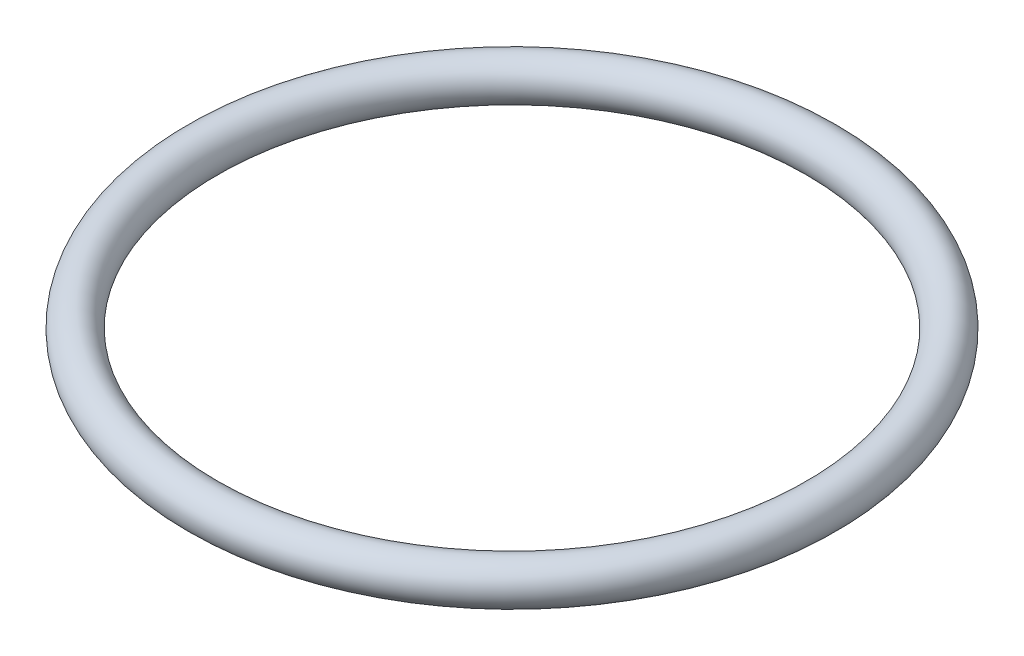
ISO-10303-21;
HEADER;
FILE_DESCRIPTION(('STEP AP214'),'2;1');
FILE_NAME('part.step','',(''),(''),'','','');
FILE_SCHEMA(('AUTOMOTIVE_DESIGN { 1 0 10303 214 1 1 1 1 }'));
ENDSEC;
DATA;
#1=APPLICATION_CONTEXT('core data for automotive mechanical design processes');
#2=APPLICATION_PROTOCOL_DEFINITION('international standard','automotive_design',2000,#1);
#3=PRODUCT_CONTEXT('',#1,'mechanical');
#4=PRODUCT('Part','Part','',(#3));
#5=PRODUCT_RELATED_PRODUCT_CATEGORY('part','',(#4));
#6=PRODUCT_DEFINITION_FORMATION('','',#4);
#7=PRODUCT_DEFINITION_CONTEXT('part definition',#1,'design');
#8=PRODUCT_DEFINITION('design','',#6,#7);
#9=PRODUCT_DEFINITION_SHAPE('','',#8);
#10=(LENGTH_UNIT() NAMED_UNIT(*) SI_UNIT(.MILLI.,.METRE.));
#11=(NAMED_UNIT(*) PLANE_ANGLE_UNIT() SI_UNIT($,.RADIAN.));
#12=(NAMED_UNIT(*) SI_UNIT($,.STERADIAN.) SOLID_ANGLE_UNIT());
#13=UNCERTAINTY_MEASURE_WITH_UNIT(LENGTH_MEASURE(1.E-05),#10,'distance_accuracy_value','');
#14=(GEOMETRIC_REPRESENTATION_CONTEXT(3) GLOBAL_UNCERTAINTY_ASSIGNED_CONTEXT((#13)) GLOBAL_UNIT_ASSIGNED_CONTEXT((#10,
#11,#12)) REPRESENTATION_CONTEXT('',''));
#15=CARTESIAN_POINT('',(0.,0.,0.));
#16=DIRECTION('',(0.,0.,1.));
#17=DIRECTION('',(1.,0.,0.));
#18=AXIS2_PLACEMENT_3D('',#15,#16,#17);
#19=CARTESIAN_POINT('',(0.,0.,0.));
#20=DIRECTION('',(0.,1.,0.));
#21=DIRECTION('',(0.,0.,1.));
#22=AXIS2_PLACEMENT_3D('',#19,#20,#21);
#23=TOROIDAL_SURFACE('',#22,11.25,0.749999999999998);
#24=CARTESIAN_POINT('',(0.,0.,12.));
#25=VERTEX_POINT('',#24);
#26=VERTEX_LOOP('',#25);
#27=FACE_BOUND('',#26,.T.);
#28=ADVANCED_FACE('F30',(#27),#23,.T.);
#29=CLOSED_SHELL('',(#28));
#30=MANIFOLD_SOLID_BREP('B2',#29);
#31=ADVANCED_BREP_SHAPE_REPRESENTATION('',(#18,#30),#14);
#32=SHAPE_DEFINITION_REPRESENTATION(#9,#31);
ENDSEC;
END-ISO-10303-21;
